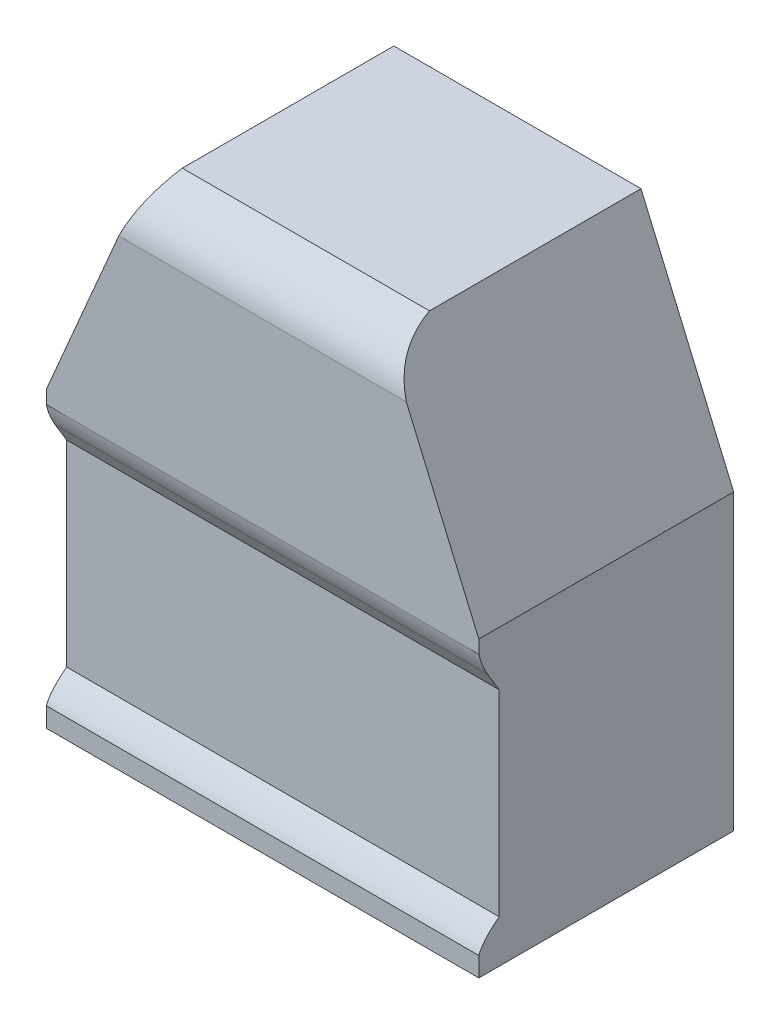
ISO-10303-21;
HEADER;
FILE_DESCRIPTION(('STEP AP214'),'2;1');
FILE_NAME('part.step','',(''),(''),'','','');
FILE_SCHEMA(('AUTOMOTIVE_DESIGN { 1 0 10303 214 1 1 1 1 }'));
ENDSEC;
DATA;
#1=APPLICATION_CONTEXT('core data for automotive mechanical design processes');
#2=APPLICATION_PROTOCOL_DEFINITION('international standard','automotive_design',2000,#1);
#3=PRODUCT_CONTEXT('',#1,'mechanical');
#4=PRODUCT('Part','Part','',(#3));
#5=PRODUCT_RELATED_PRODUCT_CATEGORY('part','',(#4));
#6=PRODUCT_DEFINITION_FORMATION('','',#4);
#7=PRODUCT_DEFINITION_CONTEXT('part definition',#1,'design');
#8=PRODUCT_DEFINITION('design','',#6,#7);
#9=PRODUCT_DEFINITION_SHAPE('','',#8);
#10=(LENGTH_UNIT() NAMED_UNIT(*) SI_UNIT(.MILLI.,.METRE.));
#11=(NAMED_UNIT(*) PLANE_ANGLE_UNIT() SI_UNIT($,.RADIAN.));
#12=(NAMED_UNIT(*) SI_UNIT($,.STERADIAN.) SOLID_ANGLE_UNIT());
#13=UNCERTAINTY_MEASURE_WITH_UNIT(LENGTH_MEASURE(1.E-05),#10,'distance_accuracy_value','');
#14=(GEOMETRIC_REPRESENTATION_CONTEXT(3) GLOBAL_UNCERTAINTY_ASSIGNED_CONTEXT((#13)) GLOBAL_UNIT_ASSIGNED_CONTEXT((#10,
#11,#12)) REPRESENTATION_CONTEXT('',''));
#15=CARTESIAN_POINT('',(0.,0.,0.));
#16=DIRECTION('',(0.,0.,1.));
#17=DIRECTION('',(1.,0.,0.));
#18=AXIS2_PLACEMENT_3D('',#15,#16,#17);
#19=CARTESIAN_POINT('',(0.,0.,100.));
#20=DIRECTION('',(0.,0.,1.));
#21=DIRECTION('',(1.,0.,0.));
#22=AXIS2_PLACEMENT_3D('',#19,#20,#21);
#23=PLANE('',#22);
#24=DIRECTION('',(1.,0.,0.));
#25=VECTOR('',#24,1.);
#26=CARTESIAN_POINT('',(-140.,86.5553657730365,100.));
#27=LINE('',#26,#25);
#28=CARTESIAN_POINT('',(140.,86.5553656803409,99.9999999805378));
#29=VERTEX_POINT('',#28);
#30=CARTESIAN_POINT('',(-140.,86.5553656803409,99.9999999805378));
#31=VERTEX_POINT('',#30);
#32=EDGE_CURVE('E41',#29,#31,#27,.F.);
#33=ORIENTED_EDGE('',*,*,#32,.F.);
#34=DIRECTION('',(0.,1.,0.));
#35=VECTOR('',#34,1.);
#36=CARTESIAN_POINT('',(140.,95.,100.));
#37=LINE('',#36,#35);
#38=CARTESIAN_POINT('',(140.,95.,100.));
#39=VERTEX_POINT('',#38);
#40=EDGE_CURVE('E187',#29,#39,#37,.T.);
#41=ORIENTED_EDGE('',*,*,#40,.T.);
#42=DIRECTION('',(-0.393919298579168,0.919145030018058,0.));
#43=VECTOR('',#42,1.);
#44=CARTESIAN_POINT('',(80.,235.,100.));
#45=LINE('',#44,#43);
#46=CARTESIAN_POINT('',(93.076029806846,204.489263784026,100.));
#47=VERTEX_POINT('',#46);
#48=EDGE_CURVE('E271',#39,#47,#45,.T.);
#49=ORIENTED_EDGE('',*,*,#48,.T.);
#50=DIRECTION('',(1.,0.,0.));
#51=VECTOR('',#50,1.);
#52=CARTESIAN_POINT('',(-140.,204.489263784026,100.));
#53=LINE('',#52,#51);
#54=CARTESIAN_POINT('',(-93.0760298068461,204.489263784026,100.));
#55=VERTEX_POINT('',#54);
#56=EDGE_CURVE('E11',#55,#47,#53,.T.);
#57=ORIENTED_EDGE('',*,*,#56,.F.);
#58=DIRECTION('',(-0.393919298579168,-0.919145030018058,0.));
#59=VECTOR('',#58,1.);
#60=CARTESIAN_POINT('',(-140.,95.,100.));
#61=LINE('',#60,#59);
#62=CARTESIAN_POINT('',(-140.,95.,100.));
#63=VERTEX_POINT('',#62);
#64=EDGE_CURVE('E270',#55,#63,#61,.T.);
#65=ORIENTED_EDGE('',*,*,#64,.T.);
#66=DIRECTION('',(0.,-1.,0.));
#67=VECTOR('',#66,1.);
#68=CARTESIAN_POINT('',(-140.,95.,100.));
#69=LINE('',#68,#67);
#70=EDGE_CURVE('E267',#63,#31,#69,.T.);
#71=ORIENTED_EDGE('',*,*,#70,.T.);
#72=EDGE_LOOP('',(#33,#41,#49,#57,#65,#71));
#73=FACE_BOUND('',#72,.T.);
#74=ADVANCED_FACE('F33',(#73),#23,.T.);
#75=CARTESIAN_POINT('',(140.,95.,-65.));
#76=DIRECTION('',(1.,0.,0.));
#77=DIRECTION('',(0.,1.,0.));
#78=AXIS2_PLACEMENT_3D('',#75,#76,#77);
#79=PLANE('',#78);
#80=CARTESIAN_POINT('',(140.,72.5253947789386,94.3842410476562));
#81=CARTESIAN_POINT('',(140.,82.398786726313,100.352557358459));
#82=CARTESIAN_POINT('',(140.,93.0615646818273,102.22447700924));
#83=CARTESIAN_POINT('',(140.,104.513728645482,100.));
#84=B_SPLINE_CURVE_WITH_KNOTS('',3,(#80,#81,#82,#83),.UNSPECIFIED.,.F.,.F.,(4,4),(0.,1.),.UNSPECIFIED.);
#85=CARTESIAN_POINT('',(140.,72.5253947789386,94.3842410476562));
#86=VERTEX_POINT('',#85);
#87=EDGE_CURVE('E144',#86,#29,#84,.T.);
#88=ORIENTED_EDGE('',*,*,#87,.F.);
#89=DIRECTION('',(0.,0.855794979187624,0.517315139539965));
#90=VECTOR('',#89,1.);
#91=CARTESIAN_POINT('',(140.,72.5253947789386,94.3842410476562));
#92=LINE('',#91,#90);
#93=CARTESIAN_POINT('',(140.,60.0814458895706,86.862061889463));
#94=VERTEX_POINT('',#93);
#95=EDGE_CURVE('E146',#94,#86,#92,.T.);
#96=ORIENTED_EDGE('',*,*,#95,.F.);
#97=DIRECTION('',(0.,1.,0.));
#98=VECTOR('',#97,1.);
#99=CARTESIAN_POINT('',(140.,60.0814458895706,86.862061889463));
#100=LINE('',#99,#98);
#101=CARTESIAN_POINT('',(140.,-67.213116322276,86.862061889463));
#102=VERTEX_POINT('',#101);
#103=EDGE_CURVE('E305',#102,#94,#100,.T.);
#104=ORIENTED_EDGE('',*,*,#103,.F.);
#105=CARTESIAN_POINT('',(140.,-95.,100.));
#106=CARTESIAN_POINT('',(140.,-83.1012135305691,104.810422505388));
#107=CARTESIAN_POINT('',(140.,-73.563203776567,95.0402307620673));
#108=CARTESIAN_POINT('',(140.,-67.213116322276,86.862061889463));
#109=B_SPLINE_CURVE_WITH_KNOTS('',3,(#105,#106,#107,#108),.UNSPECIFIED.,.F.,.F.,(4,4),(0.,1.),.UNSPECIFIED.);
#110=CARTESIAN_POINT('',(140.,-82.3654849475145,99.9999999805053));
#111=VERTEX_POINT('',#110);
#112=EDGE_CURVE('E124',#111,#102,#109,.T.);
#113=ORIENTED_EDGE('',*,*,#112,.F.);
#114=CARTESIAN_POINT('',(140.,-95.,100.));
#115=VERTEX_POINT('',#114);
#116=EDGE_CURVE('E188',#115,#111,#37,.T.);
#117=ORIENTED_EDGE('',*,*,#116,.F.);
#118=DIRECTION('',(0.,0.,1.));
#119=VECTOR('',#118,1.);
#120=CARTESIAN_POINT('',(140.,-95.,-65.));
#121=LINE('',#120,#119);
#122=CARTESIAN_POINT('',(140.,-95.,-65.));
#123=VERTEX_POINT('',#122);
#124=EDGE_CURVE('E229',#123,#115,#121,.T.);
#125=ORIENTED_EDGE('',*,*,#124,.F.);
#126=DIRECTION('',(0.,1.,0.));
#127=VECTOR('',#126,1.);
#128=CARTESIAN_POINT('',(140.,95.,-65.));
#129=LINE('',#128,#127);
#130=CARTESIAN_POINT('',(140.,95.,-65.));
#131=VERTEX_POINT('',#130);
#132=EDGE_CURVE('E262',#123,#131,#129,.T.);
#133=ORIENTED_EDGE('',*,*,#132,.T.);
#134=DIRECTION('',(0.,0.,1.));
#135=VECTOR('',#134,1.);
#136=CARTESIAN_POINT('',(140.,95.,-65.));
#137=LINE('',#136,#135);
#138=EDGE_CURVE('E234',#131,#39,#137,.T.);
#139=ORIENTED_EDGE('',*,*,#138,.T.);
#140=ORIENTED_EDGE('',*,*,#40,.F.);
#141=EDGE_LOOP('',(#88,#96,#104,#113,#117,#125,#133,#139,#140));
#142=FACE_BOUND('',#141,.T.);
#143=ADVANCED_FACE('F35',(#142),#79,.T.);
#144=CARTESIAN_POINT('',(-140.,-95.,-65.));
#145=DIRECTION('',(0.,-1.,0.));
#146=DIRECTION('',(0.,0.,-1.));
#147=AXIS2_PLACEMENT_3D('',#144,#145,#146);
#148=PLANE('',#147);
#149=ORIENTED_EDGE('',*,*,#124,.T.);
#150=DIRECTION('',(1.,0.,0.));
#151=VECTOR('',#150,1.);
#152=CARTESIAN_POINT('',(-140.,-95.,100.));
#153=LINE('',#152,#151);
#154=CARTESIAN_POINT('',(-140.,-95.,100.));
#155=VERTEX_POINT('',#154);
#156=EDGE_CURVE('E265',#155,#115,#153,.T.);
#157=ORIENTED_EDGE('',*,*,#156,.F.);
#158=DIRECTION('',(0.,0.,1.));
#159=VECTOR('',#158,1.);
#160=CARTESIAN_POINT('',(-140.,-95.,-65.));
#161=LINE('',#160,#159);
#162=CARTESIAN_POINT('',(-140.,-95.,-65.));
#163=VERTEX_POINT('',#162);
#164=EDGE_CURVE('E231',#163,#155,#161,.T.);
#165=ORIENTED_EDGE('',*,*,#164,.F.);
#166=DIRECTION('',(1.,0.,0.));
#167=VECTOR('',#166,1.);
#168=CARTESIAN_POINT('',(-140.,-95.,-65.));
#169=LINE('',#168,#167);
#170=EDGE_CURVE('E238',#163,#123,#169,.T.);
#171=ORIENTED_EDGE('',*,*,#170,.T.);
#172=EDGE_LOOP('',(#149,#157,#165,#171));
#173=FACE_BOUND('',#172,.T.);
#174=ADVANCED_FACE('F215',(#173),#148,.T.);
#175=CARTESIAN_POINT('',(-140.,95.,-65.));
#176=DIRECTION('',(-1.,0.,0.));
#177=DIRECTION('',(0.,0.,1.));
#178=AXIS2_PLACEMENT_3D('',#175,#176,#177);
#179=PLANE('',#178);
#180=CARTESIAN_POINT('',(-140.,72.5253947789386,94.3842410476562));
#181=CARTESIAN_POINT('',(-140.,82.3987867263131,100.352557358459));
#182=CARTESIAN_POINT('',(-140.,93.0615646818273,102.22447700924));
#183=CARTESIAN_POINT('',(-140.,104.513728645482,100.));
#184=B_SPLINE_CURVE_WITH_KNOTS('',3,(#180,#181,#182,#183),.UNSPECIFIED.,.F.,.F.,(4,4),(0.,1.),.UNSPECIFIED.);
#185=CARTESIAN_POINT('',(-140.,72.5253947789386,94.3842410476562));
#186=VERTEX_POINT('',#185);
#187=EDGE_CURVE('E286',#186,#31,#184,.T.);
#188=ORIENTED_EDGE('',*,*,#187,.T.);
#189=ORIENTED_EDGE('',*,*,#70,.F.);
#190=DIRECTION('',(0.,0.,1.));
#191=VECTOR('',#190,1.);
#192=CARTESIAN_POINT('',(-140.,95.,-65.));
#193=LINE('',#192,#191);
#194=CARTESIAN_POINT('',(-140.,95.,-65.));
#195=VERTEX_POINT('',#194);
#196=EDGE_CURVE('E244',#195,#63,#193,.T.);
#197=ORIENTED_EDGE('',*,*,#196,.F.);
#198=DIRECTION('',(0.,-1.,0.));
#199=VECTOR('',#198,1.);
#200=CARTESIAN_POINT('',(-140.,95.,-65.));
#201=LINE('',#200,#199);
#202=EDGE_CURVE('E250',#195,#163,#201,.T.);
#203=ORIENTED_EDGE('',*,*,#202,.T.);
#204=ORIENTED_EDGE('',*,*,#164,.T.);
#205=CARTESIAN_POINT('',(-140.,-82.3654849475144,100.));
#206=VERTEX_POINT('',#205);
#207=EDGE_CURVE('E143',#206,#155,#69,.T.);
#208=ORIENTED_EDGE('',*,*,#207,.F.);
#209=CARTESIAN_POINT('',(-140.,-95.,100.));
#210=CARTESIAN_POINT('',(-140.,-83.1012135305691,104.810422505388));
#211=CARTESIAN_POINT('',(-140.,-73.5632037765669,95.0402307620673));
#212=CARTESIAN_POINT('',(-140.,-67.2131163222759,86.862061889463));
#213=B_SPLINE_CURVE_WITH_KNOTS('',3,(#209,#210,#211,#212),.UNSPECIFIED.,.F.,.F.,(4,4),(0.,1.),.UNSPECIFIED.);
#214=CARTESIAN_POINT('',(-140.,-67.2131163222759,86.862061889463));
#215=VERTEX_POINT('',#214);
#216=EDGE_CURVE('E48',#206,#215,#213,.T.);
#217=ORIENTED_EDGE('',*,*,#216,.T.);
#218=DIRECTION('',(0.,1.,0.));
#219=VECTOR('',#218,1.);
#220=CARTESIAN_POINT('',(-140.,60.0814458895707,86.862061889463));
#221=LINE('',#220,#219);
#222=CARTESIAN_POINT('',(-140.,60.0814458895707,86.862061889463));
#223=VERTEX_POINT('',#222);
#224=EDGE_CURVE('E132',#215,#223,#221,.T.);
#225=ORIENTED_EDGE('',*,*,#224,.T.);
#226=DIRECTION('',(0.,0.855794979187624,0.517315139539965));
#227=VECTOR('',#226,1.);
#228=CARTESIAN_POINT('',(-140.,72.5253947789386,94.3842410476562));
#229=LINE('',#228,#227);
#230=EDGE_CURVE('E137',#223,#186,#229,.T.);
#231=ORIENTED_EDGE('',*,*,#230,.T.);
#232=EDGE_LOOP('',(#188,#189,#197,#203,#204,#208,#217,#225,#231));
#233=FACE_BOUND('',#232,.T.);
#234=ADVANCED_FACE('F141',(#233),#179,.T.);
#235=CARTESIAN_POINT('',(-140.,95.,-65.));
#236=DIRECTION('',(-0.919145030018058,0.393919298579168,0.));
#237=DIRECTION('',(-0.393919298579168,-0.919145030018058,0.));
#238=AXIS2_PLACEMENT_3D('',#235,#236,#237);
#239=PLANE('',#238);
#240=CARTESIAN_POINT('',(-80.,235.,71.9362874570998));
#241=CARTESIAN_POINT('',(-80.0891282665696,234.792034044671,72.5733296668578));
#242=CARTESIAN_POINT('',(-80.1822389169741,234.574775860394,73.2068414301876));
#243=CARTESIAN_POINT('',(-80.3771202748638,234.120052691985,74.4670828238654));
#244=CARTESIAN_POINT('',(-80.478912518841,233.882537456038,75.0937909683966));
#245=CARTESIAN_POINT('',(-80.6915434753718,233.386398557466,76.3382651265193));
#246=CARTESIAN_POINT('',(-80.8023941240503,233.127747043883,76.9560180364117));
#247=CARTESIAN_POINT('',(-81.0335109712951,232.588474400312,78.1803932303701));
#248=CARTESIAN_POINT('',(-81.1537809195842,232.30784452097,78.787010961801));
#249=CARTESIAN_POINT('',(-81.4051585750343,231.721296658253,79.9921155524989));
#250=CARTESIAN_POINT('',(-81.5363483095605,231.415187277692,80.5904923944304));
#251=CARTESIAN_POINT('',(-81.80898246639,230.779040911757,81.7715275566926));
#252=CARTESIAN_POINT('',(-81.9504204574291,230.449018932665,82.3541954254499));
#253=CARTESIAN_POINT('',(-82.2438447902656,229.764362156047,83.5016721773314));
#254=CARTESIAN_POINT('',(-82.3958244871125,229.409742863404,84.0664919898962));
#255=CARTESIAN_POINT('',(-82.7105884646899,228.67529358239,85.1761917988735));
#256=CARTESIAN_POINT('',(-82.8733698485969,228.295470353274,85.7210770810534));
#257=CARTESIAN_POINT('',(-83.2089602417611,227.512426102557,86.7857586624662));
#258=CARTESIAN_POINT('',(-83.381710019073,227.10934328883,87.3056751002947));
#259=CARTESIAN_POINT('',(-83.738006584946,226.277984635126,88.3212064013561));
#260=CARTESIAN_POINT('',(-83.9215542912963,225.849706653642,88.8168191922743));
#261=CARTESIAN_POINT('',(-84.2992317235797,224.968459311648,89.7813563045149));
#262=CARTESIAN_POINT('',(-84.4933612934157,224.515490315363,90.2502810193146));
#263=CARTESIAN_POINT('',(-84.890910402214,223.587875728167,91.1571638244724));
#264=CARTESIAN_POINT('',(-85.0942824045138,223.113341056135,91.5952561076383));
#265=CARTESIAN_POINT('',(-85.5106305128489,222.141862136686,92.4409977152423));
#266=CARTESIAN_POINT('',(-85.7236068199421,221.644917420135,92.8486464018947));
#267=CARTESIAN_POINT('',(-86.1584858107272,220.63019977497,93.6319607284079));
#268=CARTESIAN_POINT('',(-86.3803878716175,220.112428299559,94.0076285940753));
#269=CARTESIAN_POINT('',(-86.7759244882065,219.189509527518,94.6362703997323));
#270=CARTESIAN_POINT('',(-86.9477860580415,218.788499197903,94.8964687021156));
#271=CARTESIAN_POINT('',(-87.2957456961108,217.976593375741,95.398005922306));
#272=CARTESIAN_POINT('',(-87.4718440483212,217.565697220584,95.6393435713214));
#273=CARTESIAN_POINT('',(-87.8278833770636,216.734938786852,96.102995614017));
#274=CARTESIAN_POINT('',(-88.007824344897,216.315076528574,96.3253100507554));
#275=CARTESIAN_POINT('',(-88.3711657769288,215.467279853833,96.7509438554658));
#276=CARTESIAN_POINT('',(-88.5545665543224,215.039344706581,96.9542614937609));
#277=CARTESIAN_POINT('',(-89.1102676949757,213.742708711723,97.5368288113898));
#278=CARTESIAN_POINT('',(-89.4872506266299,212.863081871197,97.8876351133225));
#279=CARTESIAN_POINT('',(-90.2504327140856,211.082323667134,98.5158314934096));
#280=CARTESIAN_POINT('',(-90.6366299252838,210.181196841005,98.7932369154382));
#281=CARTESIAN_POINT('',(-91.1953305909901,208.877561954357,99.141539492772));
#282=CARTESIAN_POINT('',(-91.3651940672038,208.481213843191,99.2405143218697));
#283=CARTESIAN_POINT('',(-91.7059607089106,207.686091679209,99.4257923586741));
#284=CARTESIAN_POINT('',(-91.8768636543189,207.287318139923,99.512098157738));
#285=CARTESIAN_POINT('',(-92.2187280553576,206.489634537499,99.6720769486702));
#286=CARTESIAN_POINT('',(-92.3896852579595,206.090734398095,99.7458088291993));
#287=CARTESIAN_POINT('',(-92.7323439552588,205.291197437729,99.8815759811195));
#288=CARTESIAN_POINT('',(-92.9040455497586,204.890560383897,99.9436096311618));
#289=CARTESIAN_POINT('',(-93.0760298068461,204.489263784026,100.));
#290=B_SPLINE_CURVE_WITH_KNOTS('',3,(#240,#241,#242,#243,#244,#245,#246,#247,#248,#249,#250,
#251,#252,#253,#254,#255,#256,#257,#258,#259,#260,#261,#262,#263,#264,#265,#266,#267,#268,#269,
#270,#271,#272,#273,#274,#275,#276,#277,#278,#279,#280,#281,#282,#283,#284,#285,#286,#287,#288,
#289),.UNSPECIFIED.,.F.,.F.,(4,2,2,2,2,2,2,2,2,2,2,2,2,2,2,2,2,2,2,2,2,2,2,2,4),(0.,
2.02808937355803,4.06136494501843,6.09736432594281,8.13417837706916,10.1879808191637,
12.2405053834914,14.2917476975573,16.3424421103859,18.3820043216842,20.4217401403263,
22.4614458781993,24.4916411174774,26.5218788769206,28.5519752198168,30.075488767877,
31.5991047175065,33.1227172184094,34.6464683107913,37.7009289280338,40.754750529055,
42.0818866170079,43.4087508696056,44.7292192293733,46.0498704688364),.UNSPECIFIED.);
#291=CARTESIAN_POINT('',(-80.,235.,71.9362874570997));
#292=VERTEX_POINT('',#291);
#293=EDGE_CURVE('E55',#292,#55,#290,.T.);
#294=ORIENTED_EDGE('',*,*,#293,.F.);
#295=DIRECTION('',(0.,0.,1.));
#296=VECTOR('',#295,1.);
#297=CARTESIAN_POINT('',(-80.,235.,-65.));
#298=LINE('',#297,#296);
#299=CARTESIAN_POINT('',(-80.,235.,-65.));
#300=VERTEX_POINT('',#299);
#301=EDGE_CURVE('E241',#300,#292,#298,.T.);
#302=ORIENTED_EDGE('',*,*,#301,.F.);
#303=DIRECTION('',(-0.393919298579168,-0.919145030018058,0.));
#304=VECTOR('',#303,1.);
#305=CARTESIAN_POINT('',(-140.,95.,-65.));
#306=LINE('',#305,#304);
#307=EDGE_CURVE('E253',#300,#195,#306,.T.);
#308=ORIENTED_EDGE('',*,*,#307,.T.);
#309=ORIENTED_EDGE('',*,*,#196,.T.);
#310=ORIENTED_EDGE('',*,*,#64,.F.);
#311=EDGE_LOOP('',(#294,#302,#308,#309,#310));
#312=FACE_BOUND('',#311,.T.);
#313=ADVANCED_FACE('F190',(#312),#239,.T.);
#314=CARTESIAN_POINT('',(80.,235.,-65.));
#315=DIRECTION('',(0.,1.,0.));
#316=DIRECTION('',(-1.,0.,0.));
#317=AXIS2_PLACEMENT_3D('',#314,#315,#316);
#318=PLANE('',#317);
#319=DIRECTION('',(1.,0.,0.));
#320=VECTOR('',#319,1.);
#321=CARTESIAN_POINT('',(-140.,235.,71.9362874570997));
#322=LINE('',#321,#320);
#323=CARTESIAN_POINT('',(80.,235.,71.9362874570997));
#324=VERTEX_POINT('',#323);
#325=EDGE_CURVE('E129',#292,#324,#322,.T.);
#326=ORIENTED_EDGE('',*,*,#325,.T.);
#327=DIRECTION('',(0.,0.,1.));
#328=VECTOR('',#327,1.);
#329=CARTESIAN_POINT('',(80.,235.,-65.));
#330=LINE('',#329,#328);
#331=CARTESIAN_POINT('',(80.,235.,-65.));
#332=VERTEX_POINT('',#331);
#333=EDGE_CURVE('E237',#332,#324,#330,.T.);
#334=ORIENTED_EDGE('',*,*,#333,.F.);
#335=DIRECTION('',(-1.,0.,0.));
#336=VECTOR('',#335,1.);
#337=CARTESIAN_POINT('',(80.,235.,-65.));
#338=LINE('',#337,#336);
#339=EDGE_CURVE('E256',#332,#300,#338,.T.);
#340=ORIENTED_EDGE('',*,*,#339,.T.);
#341=ORIENTED_EDGE('',*,*,#301,.T.);
#342=EDGE_LOOP('',(#326,#334,#340,#341));
#343=FACE_BOUND('',#342,.T.);
#344=ADVANCED_FACE('F195',(#343),#318,.T.);
#345=CARTESIAN_POINT('',(80.,235.,-65.));
#346=DIRECTION('',(0.919145030018058,0.393919298579168,0.));
#347=DIRECTION('',(-0.393919298579168,0.919145030018058,0.));
#348=AXIS2_PLACEMENT_3D('',#345,#346,#347);
#349=PLANE('',#348);
#350=CARTESIAN_POINT('',(93.076029806846,204.489263784026,100.));
#351=CARTESIAN_POINT('',(92.851609573459,205.012910995262,99.9264191312159));
#352=CARTESIAN_POINT('',(92.6276621828559,205.53545490667,99.8432223957373));
#353=CARTESIAN_POINT('',(92.1807389908115,206.578275688106,99.6565309069485));
#354=CARTESIAN_POINT('',(91.9577651692037,207.098547938525,99.5530056676482));
#355=CARTESIAN_POINT('',(91.5133320750855,208.135558491467,99.324723677601));
#356=CARTESIAN_POINT('',(91.2918740378894,208.652293911591,99.1999513585754));
#357=CARTESIAN_POINT('',(90.8510210792031,209.680950815193,98.928334581298));
#358=CARTESIAN_POINT('',(90.6316265356573,210.1928714168,98.7814861601846));
#359=CARTESIAN_POINT('',(90.1949772279914,211.211719801353,98.4646373552746));
#360=CARTESIAN_POINT('',(89.9777274819001,211.718635875566,98.2945922990571));
#361=CARTESIAN_POINT('',(89.5463871263808,212.725096705112,97.9309628058862));
#362=CARTESIAN_POINT('',(89.3322954148611,213.224644031991,97.7373868096648));
#363=CARTESIAN_POINT('',(88.9077908795032,214.215154614492,97.3261878899193));
#364=CARTESIAN_POINT('',(88.6973770123879,214.706120304428,97.1085719182604));
#365=CARTESIAN_POINT('',(88.2807284753126,215.678300224271,96.6489200603582));
#366=CARTESIAN_POINT('',(88.0744937419778,216.159514602052,96.4068845447604));
#367=CARTESIAN_POINT('',(87.6648605739683,217.115325327407,95.8958935400884));
#368=CARTESIAN_POINT('',(87.4615067663847,217.589817545102,95.6267072472796));
#369=CARTESIAN_POINT('',(87.0601667846449,218.526277502495,95.0633968542612));
#370=CARTESIAN_POINT('',(86.8621818591484,218.988242328654,94.7692670173906));
#371=CARTESIAN_POINT('',(86.4721741961936,219.898260208882,94.1564961344039));
#372=CARTESIAN_POINT('',(86.2801517148253,220.346312665408,93.8378540375118));
#373=CARTESIAN_POINT('',(85.9026025725162,221.227260664129,93.1767382094995));
#374=CARTESIAN_POINT('',(85.7170754266511,221.660157337814,92.8342662631794));
#375=CARTESIAN_POINT('',(85.353435608919,222.508650245856,92.1272957603278));
#376=CARTESIAN_POINT('',(85.1753045307904,222.924289428156,91.7628582047013));
#377=CARTESIAN_POINT('',(84.8263045193369,223.738622788214,91.0122192781612));
#378=CARTESIAN_POINT('',(84.6554357089632,224.137316679086,90.626017539034));
#379=CARTESIAN_POINT('',(84.3212447514448,224.917095579962,89.8330964173066));
#380=CARTESIAN_POINT('',(84.1579228375679,225.298180045675,89.4263764013166));
#381=CARTESIAN_POINT('',(83.839049417931,226.042218024828,88.593867972621));
#382=CARTESIAN_POINT('',(83.6834972175332,226.405173159089,88.1680812710174));
#383=CARTESIAN_POINT('',(83.3181838018128,227.257571129103,87.1209067231101));
#384=CARTESIAN_POINT('',(83.1122920418719,227.737985235632,86.4907858872558));
#385=CARTESIAN_POINT('',(82.7161609025447,228.662291227396,85.1996003656828));
#386=CARTESIAN_POINT('',(82.5259233544039,229.106178839724,84.5385320738506));
#387=CARTESIAN_POINT('',(82.1608445382386,229.958029410777,83.189510246313));
#388=CARTESIAN_POINT('',(81.9860047005649,230.365989032015,82.501554221458));
#389=CARTESIAN_POINT('',(81.6509269688317,231.147837072726,81.1012074650365));
#390=CARTESIAN_POINT('',(81.4907200998561,231.521653100336,80.3887690311897));
#391=CARTESIAN_POINT('',(81.1847078452887,232.235681694326,78.9444281353509));
#392=CARTESIAN_POINT('',(81.0389003576172,232.57589916556,78.2125285342375));
#393=CARTESIAN_POINT('',(80.7609700609088,233.224403191213,76.7324889595337));
#394=CARTESIAN_POINT('',(80.6288429713402,233.532699733539,75.9843541550257));
#395=CARTESIAN_POINT('',(80.4126864652839,234.037064914337,74.6860416528942));
#396=CARTESIAN_POINT('',(80.3255572370212,234.24036644695,74.1391645661177));
#397=CARTESIAN_POINT('',(80.1579653757761,234.631414123189,73.0411705823226));
#398=CARTESIAN_POINT('',(80.0774794372923,234.819214646318,72.490076628542));
#399=CARTESIAN_POINT('',(80.,235.,71.9362874570997));
#400=B_SPLINE_CURVE_WITH_KNOTS('',3,(#350,#351,#352,#353,#354,#355,#356,#357,#358,#359,#360,
#361,#362,#363,#364,#365,#366,#367,#368,#369,#370,#371,#372,#373,#374,#375,#376,#377,#378,#379,
#380,#381,#382,#383,#384,#385,#386,#387,#388,#389,#390,#391,#392,#393,#394,#395,#396,#397,#398,
#399),.UNSPECIFIED.,.F.,.F.,(4,2,2,2,2,2,2,2,2,2,2,2,2,2,2,2,2,2,2,2,2,2,2,2,4),(0.,
1.72330919367075,3.44922279180089,5.17640649575216,6.903900615959,8.63476981362137,
10.3650199570419,12.0947710511588,13.8244958946673,15.5704138535559,17.3167344434294,
19.0631299352197,20.8093947665643,22.5510154906979,24.2926656889958,26.0343696841718,
27.7759176855889,30.2302358183727,32.6848406528191,35.1396732646858,37.5995953709039,
40.0591578352987,42.5179483736733,44.287445944209,46.0504457500123),.UNSPECIFIED.);
#401=EDGE_CURVE('E174',#47,#324,#400,.T.);
#402=ORIENTED_EDGE('',*,*,#401,.F.);
#403=ORIENTED_EDGE('',*,*,#48,.F.);
#404=ORIENTED_EDGE('',*,*,#138,.F.);
#405=DIRECTION('',(-0.393919298579168,0.919145030018058,0.));
#406=VECTOR('',#405,1.);
#407=CARTESIAN_POINT('',(80.,235.,-65.));
#408=LINE('',#407,#406);
#409=EDGE_CURVE('E259',#131,#332,#408,.T.);
#410=ORIENTED_EDGE('',*,*,#409,.T.);
#411=ORIENTED_EDGE('',*,*,#333,.T.);
#412=EDGE_LOOP('',(#402,#403,#404,#410,#411));
#413=FACE_BOUND('',#412,.T.);
#414=ADVANCED_FACE('F199',(#413),#349,.T.);
#415=CARTESIAN_POINT('',(0.,0.,-65.));
#416=DIRECTION('',(0.,0.,1.));
#417=DIRECTION('',(1.,0.,0.));
#418=AXIS2_PLACEMENT_3D('',#415,#416,#417);
#419=PLANE('',#418);
#420=ORIENTED_EDGE('',*,*,#132,.F.);
#421=ORIENTED_EDGE('',*,*,#170,.F.);
#422=ORIENTED_EDGE('',*,*,#202,.F.);
#423=ORIENTED_EDGE('',*,*,#307,.F.);
#424=ORIENTED_EDGE('',*,*,#339,.F.);
#425=ORIENTED_EDGE('',*,*,#409,.F.);
#426=EDGE_LOOP('',(#420,#421,#422,#423,#424,#425));
#427=FACE_BOUND('',#426,.T.);
#428=ADVANCED_FACE('F203',(#427),#419,.F.);
#429=DIRECTION('',(1.,0.,0.));
#430=VECTOR('',#429,1.);
#431=CARTESIAN_POINT('',(-140.,-82.3654849959016,100.));
#432=LINE('',#431,#430);
#433=EDGE_CURVE('E226',#206,#111,#432,.T.);
#434=ORIENTED_EDGE('',*,*,#433,.F.);
#435=ORIENTED_EDGE('',*,*,#207,.T.);
#436=ORIENTED_EDGE('',*,*,#156,.T.);
#437=ORIENTED_EDGE('',*,*,#116,.T.);
#438=EDGE_LOOP('',(#434,#435,#436,#437));
#439=FACE_BOUND('',#438,.T.);
#440=ADVANCED_FACE('F170',(#439),#23,.T.);
#441=DIRECTION('',(1.,0.,0.));
#442=VECTOR('',#441,1.);
#443=SURFACE_OF_LINEAR_EXTRUSION('',#184,#442);
#444=ORIENTED_EDGE('',*,*,#32,.T.);
#445=ORIENTED_EDGE('',*,*,#187,.F.);
#446=DIRECTION('',(1.,0.,0.));
#447=VECTOR('',#446,1.);
#448=CARTESIAN_POINT('',(-140.,72.5253947789386,94.3842410476562));
#449=LINE('',#448,#447);
#450=EDGE_CURVE('E278',#186,#86,#449,.T.);
#451=ORIENTED_EDGE('',*,*,#450,.T.);
#452=ORIENTED_EDGE('',*,*,#87,.T.);
#453=EDGE_LOOP('',(#444,#445,#451,#452));
#454=FACE_BOUND('',#453,.T.);
#455=ADVANCED_FACE('F163',(#454),#443,.F.);
#456=DIRECTION('',(1.,0.,0.));
#457=VECTOR('',#456,1.);
#458=SURFACE_OF_LINEAR_EXTRUSION('',#213,#457);
#459=ORIENTED_EDGE('',*,*,#433,.T.);
#460=ORIENTED_EDGE('',*,*,#112,.T.);
#461=DIRECTION('',(1.,0.,0.));
#462=VECTOR('',#461,1.);
#463=CARTESIAN_POINT('',(-140.,-67.2131163222759,86.862061889463));
#464=LINE('',#463,#462);
#465=EDGE_CURVE('E120',#215,#102,#464,.T.);
#466=ORIENTED_EDGE('',*,*,#465,.F.);
#467=ORIENTED_EDGE('',*,*,#216,.F.);
#468=EDGE_LOOP('',(#459,#460,#466,#467));
#469=FACE_BOUND('',#468,.T.);
#470=ADVANCED_FACE('F122',(#469),#458,.F.);
#471=CARTESIAN_POINT('',(-140.,60.0814458895707,86.862061889463));
#472=DIRECTION('',(0.,0.,-1.));
#473=DIRECTION('',(-1.,0.,0.));
#474=AXIS2_PLACEMENT_3D('',#471,#472,#473);
#475=PLANE('',#474);
#476=ORIENTED_EDGE('',*,*,#103,.T.);
#477=DIRECTION('',(1.,0.,0.));
#478=VECTOR('',#477,1.);
#479=CARTESIAN_POINT('',(-140.,60.0814458895707,86.862061889463));
#480=LINE('',#479,#478);
#481=EDGE_CURVE('E128',#223,#94,#480,.T.);
#482=ORIENTED_EDGE('',*,*,#481,.F.);
#483=ORIENTED_EDGE('',*,*,#224,.F.);
#484=ORIENTED_EDGE('',*,*,#465,.T.);
#485=EDGE_LOOP('',(#476,#482,#483,#484));
#486=FACE_BOUND('',#485,.T.);
#487=ADVANCED_FACE('F133',(#486),#475,.F.);
#488=CARTESIAN_POINT('',(-140.,72.5253947789386,94.3842410476562));
#489=DIRECTION('',(0.,0.517315139539965,-0.855794979187624));
#490=DIRECTION('',(0.,0.855794979187624,0.517315139539965));
#491=AXIS2_PLACEMENT_3D('',#488,#489,#490);
#492=PLANE('',#491);
#493=ORIENTED_EDGE('',*,*,#95,.T.);
#494=ORIENTED_EDGE('',*,*,#450,.F.);
#495=ORIENTED_EDGE('',*,*,#230,.F.);
#496=ORIENTED_EDGE('',*,*,#481,.T.);
#497=EDGE_LOOP('',(#493,#494,#495,#496));
#498=FACE_BOUND('',#497,.T.);
#499=ADVANCED_FACE('F169',(#498),#492,.F.);
#500=CARTESIAN_POINT('',(-140.,190.377151129361,100.));
#501=CARTESIAN_POINT('',(-140.,224.516044216558,104.05237160198));
#502=CARTESIAN_POINT('',(-140.,235.,71.9362874570997));
#503=B_SPLINE_CURVE_WITH_KNOTS('',2,(#500,#501,#502),.UNSPECIFIED.,.F.,.F.,(3,3),(0.,1.),.UNSPECIFIED.);
#504=DIRECTION('',(1.,0.,0.));
#505=VECTOR('',#504,1.);
#506=SURFACE_OF_LINEAR_EXTRUSION('',#503,#505);
#507=ORIENTED_EDGE('',*,*,#293,.T.);
#508=ORIENTED_EDGE('',*,*,#56,.T.);
#509=ORIENTED_EDGE('',*,*,#401,.T.);
#510=ORIENTED_EDGE('',*,*,#325,.F.);
#511=EDGE_LOOP('',(#507,#508,#509,#510));
#512=FACE_BOUND('',#511,.T.);
#513=ADVANCED_FACE('F165',(#512),#506,.F.);
#514=CLOSED_SHELL('',(#74,#143,#174,#234,#313,#344,#414,#428,#440,#455,#470,#487,#499,#513));
#515=MANIFOLD_SOLID_BREP('B2',#514);
#516=ADVANCED_BREP_SHAPE_REPRESENTATION('',(#18,#515),#14);
#517=SHAPE_DEFINITION_REPRESENTATION(#9,#516);
ENDSEC;
END-ISO-10303-21;
